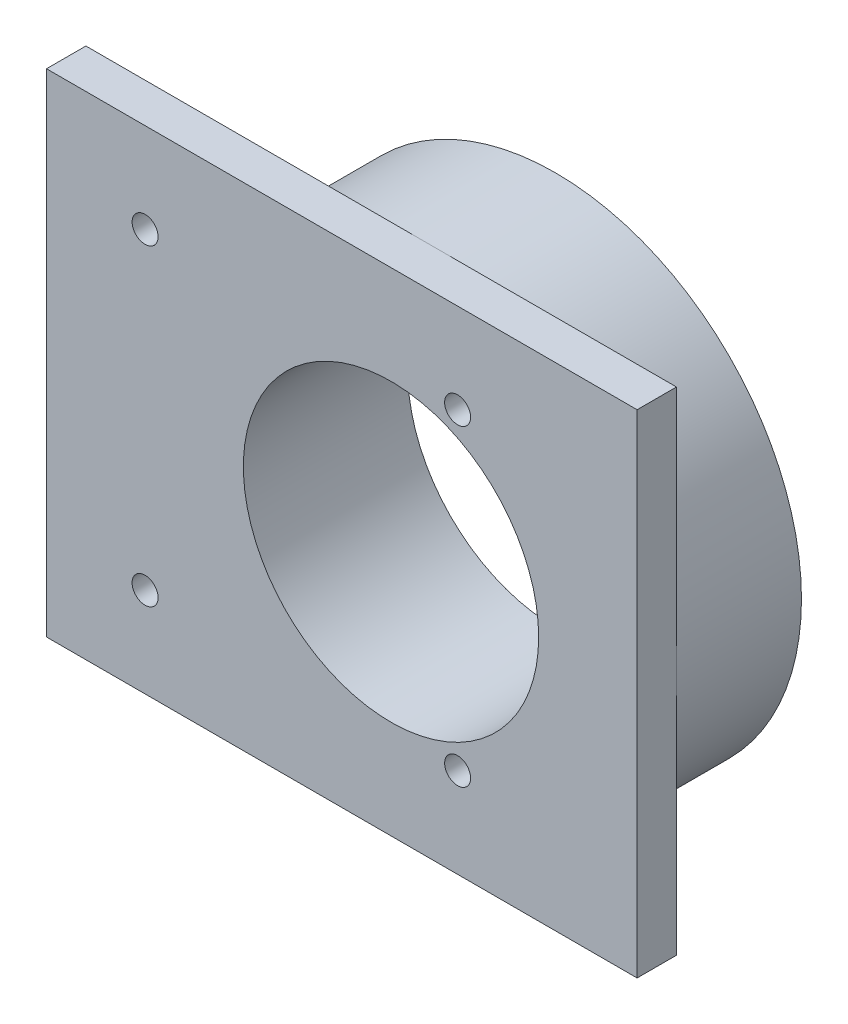
ISO-10303-21;
HEADER;
FILE_DESCRIPTION(('STEP AP214'),'2;1');
FILE_NAME('part.step','',(''),(''),'','','');
FILE_SCHEMA(('AUTOMOTIVE_DESIGN { 1 0 10303 214 1 1 1 1 }'));
ENDSEC;
DATA;
#1=APPLICATION_CONTEXT('core data for automotive mechanical design processes');
#2=APPLICATION_PROTOCOL_DEFINITION('international standard','automotive_design',2000,#1);
#3=PRODUCT_CONTEXT('',#1,'mechanical');
#4=PRODUCT('Part','Part','',(#3));
#5=PRODUCT_RELATED_PRODUCT_CATEGORY('part','',(#4));
#6=PRODUCT_DEFINITION_FORMATION('','',#4);
#7=PRODUCT_DEFINITION_CONTEXT('part definition',#1,'design');
#8=PRODUCT_DEFINITION('design','',#6,#7);
#9=PRODUCT_DEFINITION_SHAPE('','',#8);
#10=(LENGTH_UNIT() NAMED_UNIT(*) SI_UNIT(.MILLI.,.METRE.));
#11=(NAMED_UNIT(*) PLANE_ANGLE_UNIT() SI_UNIT($,.RADIAN.));
#12=(NAMED_UNIT(*) SI_UNIT($,.STERADIAN.) SOLID_ANGLE_UNIT());
#13=UNCERTAINTY_MEASURE_WITH_UNIT(LENGTH_MEASURE(1.E-05),#10,'distance_accuracy_value','');
#14=(GEOMETRIC_REPRESENTATION_CONTEXT(3) GLOBAL_UNCERTAINTY_ASSIGNED_CONTEXT((#13)) GLOBAL_UNIT_ASSIGNED_CONTEXT((#10,
#11,#12)) REPRESENTATION_CONTEXT('',''));
#15=CARTESIAN_POINT('',(0.,0.,0.));
#16=DIRECTION('',(0.,0.,1.));
#17=DIRECTION('',(1.,0.,0.));
#18=AXIS2_PLACEMENT_3D('',#15,#16,#17);
#19=CARTESIAN_POINT('',(0.,0.,12.7));
#20=DIRECTION('',(0.,0.,-1.));
#21=DIRECTION('',(-1.,0.,0.));
#22=AXIS2_PLACEMENT_3D('',#19,#20,#21);
#23=CYLINDRICAL_SURFACE('',#22,25.);
#24=CARTESIAN_POINT('',(0.,0.,12.7));
#25=DIRECTION('',(0.,0.,1.));
#26=DIRECTION('',(1.,0.,0.));
#27=AXIS2_PLACEMENT_3D('',#24,#25,#26);
#28=CIRCLE('',#27,25.);
#29=CARTESIAN_POINT('',(25.,0.,12.7));
#30=VERTEX_POINT('',#29);
#31=CARTESIAN_POINT('',(0.,25.,12.7));
#32=VERTEX_POINT('',#31);
#33=EDGE_CURVE('E11',#30,#32,#28,.T.);
#34=ORIENTED_EDGE('',*,*,#33,.F.);
#35=CARTESIAN_POINT('',(0.,-25.,12.7));
#36=VERTEX_POINT('',#35);
#37=EDGE_CURVE('E42',#36,#30,#28,.T.);
#38=ORIENTED_EDGE('',*,*,#37,.F.);
#39=EDGE_CURVE('E41',#32,#36,#28,.T.);
#40=ORIENTED_EDGE('',*,*,#39,.F.);
#41=EDGE_LOOP('',(#34,#38,#40));
#42=FACE_BOUND('',#41,.T.);
#43=CARTESIAN_POINT('',(0.,0.,0.));
#44=DIRECTION('',(0.,0.,1.));
#45=DIRECTION('',(1.,0.,0.));
#46=AXIS2_PLACEMENT_3D('',#43,#44,#45);
#47=CIRCLE('',#46,25.);
#48=CARTESIAN_POINT('',(25.,0.,0.));
#49=VERTEX_POINT('',#48);
#50=EDGE_CURVE('E36',#49,#49,#47,.T.);
#51=ORIENTED_EDGE('',*,*,#50,.T.);
#52=EDGE_LOOP('',(#51));
#53=FACE_BOUND('',#52,.T.);
#54=ADVANCED_FACE('F33',(#42,#53),#23,.T.);
#55=CARTESIAN_POINT('',(0.,0.,0.));
#56=DIRECTION('',(0.,0.,1.));
#57=DIRECTION('',(1.,0.,0.));
#58=AXIS2_PLACEMENT_3D('',#55,#56,#57);
#59=PLANE('',#58);
#60=CARTESIAN_POINT('',(0.,0.,0.));
#61=DIRECTION('',(0.,0.,1.));
#62=DIRECTION('',(1.,0.,0.));
#63=AXIS2_PLACEMENT_3D('',#60,#61,#62);
#64=CIRCLE('',#63,15.);
#65=CARTESIAN_POINT('',(15.,0.,0.));
#66=VERTEX_POINT('',#65);
#67=EDGE_CURVE('E151',#66,#66,#64,.T.);
#68=ORIENTED_EDGE('',*,*,#67,.T.);
#69=EDGE_LOOP('',(#68));
#70=FACE_BOUND('',#69,.T.);
#71=CARTESIAN_POINT('',(6.765,-15.875,0.));
#72=DIRECTION('',(0.,0.,1.));
#73=DIRECTION('',(1.,0.,0.));
#74=AXIS2_PLACEMENT_3D('',#71,#72,#73);
#75=CIRCLE('',#74,1.32);
#76=CARTESIAN_POINT('',(8.085,-15.875,0.));
#77=VERTEX_POINT('',#76);
#78=EDGE_CURVE('E137',#77,#77,#75,.T.);
#79=ORIENTED_EDGE('',*,*,#78,.T.);
#80=EDGE_LOOP('',(#79));
#81=FACE_BOUND('',#80,.T.);
#82=CARTESIAN_POINT('',(6.76499999999999,15.875,0.));
#83=DIRECTION('',(0.,0.,1.));
#84=DIRECTION('',(1.,0.,0.));
#85=AXIS2_PLACEMENT_3D('',#82,#83,#84);
#86=CIRCLE('',#85,1.32);
#87=CARTESIAN_POINT('',(8.08499999999999,15.875,0.));
#88=VERTEX_POINT('',#87);
#89=EDGE_CURVE('E133',#88,#88,#86,.T.);
#90=ORIENTED_EDGE('',*,*,#89,.T.);
#91=EDGE_LOOP('',(#90));
#92=FACE_BOUND('',#91,.T.);
#93=ORIENTED_EDGE('',*,*,#50,.F.);
#94=EDGE_LOOP('',(#93));
#95=FACE_BOUND('',#94,.T.);
#96=ADVANCED_FACE('F158',(#70,#81,#92,#95),#59,.F.);
#97=CARTESIAN_POINT('',(0.,0.,12.7));
#98=DIRECTION('',(0.,0.,1.));
#99=DIRECTION('',(1.,0.,0.));
#100=AXIS2_PLACEMENT_3D('',#97,#98,#99);
#101=PLANE('',#100);
#102=DIRECTION('',(0.,1.,0.));
#103=VECTOR('',#102,1.);
#104=CARTESIAN_POINT('',(25.,25.,12.7));
#105=LINE('',#104,#103);
#106=CARTESIAN_POINT('',(25.,25.,12.7));
#107=VERTEX_POINT('',#106);
#108=EDGE_CURVE('E120',#30,#107,#105,.T.);
#109=ORIENTED_EDGE('',*,*,#108,.F.);
#110=ORIENTED_EDGE('',*,*,#33,.T.);
#111=DIRECTION('',(-1.,0.,0.));
#112=VECTOR('',#111,1.);
#113=CARTESIAN_POINT('',(-35.,25.,12.7));
#114=LINE('',#113,#112);
#115=EDGE_CURVE('E100',#107,#32,#114,.T.);
#116=ORIENTED_EDGE('',*,*,#115,.F.);
#117=EDGE_LOOP('',(#109,#110,#116));
#118=FACE_BOUND('',#117,.T.);
#119=ADVANCED_FACE('F191',(#118),#101,.F.);
#120=CARTESIAN_POINT('',(-24.985,-15.875,12.7));
#121=DIRECTION('',(0.,0.,1.));
#122=DIRECTION('',(1.,0.,0.));
#123=AXIS2_PLACEMENT_3D('',#120,#121,#122);
#124=CIRCLE('',#123,1.32);
#125=CARTESIAN_POINT('',(-23.665,-15.875,12.7));
#126=VERTEX_POINT('',#125);
#127=EDGE_CURVE('E143',#126,#126,#124,.T.);
#128=ORIENTED_EDGE('',*,*,#127,.T.);
#129=EDGE_LOOP('',(#128));
#130=FACE_BOUND('',#129,.T.);
#131=CARTESIAN_POINT('',(-24.985,15.875,12.7));
#132=DIRECTION('',(0.,0.,1.));
#133=DIRECTION('',(1.,0.,0.));
#134=AXIS2_PLACEMENT_3D('',#131,#132,#133);
#135=CIRCLE('',#134,1.32);
#136=CARTESIAN_POINT('',(-23.665,15.875,12.7));
#137=VERTEX_POINT('',#136);
#138=EDGE_CURVE('E125',#137,#137,#135,.T.);
#139=ORIENTED_EDGE('',*,*,#138,.T.);
#140=EDGE_LOOP('',(#139));
#141=FACE_BOUND('',#140,.T.);
#142=CARTESIAN_POINT('',(-35.,25.,12.7));
#143=VERTEX_POINT('',#142);
#144=EDGE_CURVE('E116',#32,#143,#114,.T.);
#145=ORIENTED_EDGE('',*,*,#144,.F.);
#146=ORIENTED_EDGE('',*,*,#39,.T.);
#147=DIRECTION('',(1.,0.,0.));
#148=VECTOR('',#147,1.);
#149=CARTESIAN_POINT('',(-35.,-25.,12.7));
#150=LINE('',#149,#148);
#151=CARTESIAN_POINT('',(-35.,-25.,12.7));
#152=VERTEX_POINT('',#151);
#153=EDGE_CURVE('E121',#152,#36,#150,.T.);
#154=ORIENTED_EDGE('',*,*,#153,.F.);
#155=DIRECTION('',(0.,-1.,0.));
#156=VECTOR('',#155,1.);
#157=CARTESIAN_POINT('',(-35.,25.,12.7));
#158=LINE('',#157,#156);
#159=EDGE_CURVE('E104',#143,#152,#158,.T.);
#160=ORIENTED_EDGE('',*,*,#159,.F.);
#161=EDGE_LOOP('',(#145,#146,#154,#160));
#162=FACE_BOUND('',#161,.T.);
#163=ADVANCED_FACE('F187',(#130,#141,#162),#101,.F.);
#164=CARTESIAN_POINT('',(25.,-25.,12.7));
#165=VERTEX_POINT('',#164);
#166=EDGE_CURVE('E123',#36,#165,#150,.T.);
#167=ORIENTED_EDGE('',*,*,#166,.F.);
#168=ORIENTED_EDGE('',*,*,#37,.T.);
#169=EDGE_CURVE('E117',#165,#30,#105,.T.);
#170=ORIENTED_EDGE('',*,*,#169,.F.);
#171=EDGE_LOOP('',(#167,#168,#170));
#172=FACE_BOUND('',#171,.T.);
#173=ADVANCED_FACE('F190',(#172),#101,.F.);
#174=CARTESIAN_POINT('',(-35.,25.,16.7));
#175=DIRECTION('',(1.,0.,0.));
#176=DIRECTION('',(0.,1.,0.));
#177=AXIS2_PLACEMENT_3D('',#174,#175,#176);
#178=PLANE('',#177);
#179=ORIENTED_EDGE('',*,*,#159,.T.);
#180=DIRECTION('',(0.,0.,-1.));
#181=VECTOR('',#180,1.);
#182=CARTESIAN_POINT('',(-35.,-25.,16.7));
#183=LINE('',#182,#181);
#184=CARTESIAN_POINT('',(-35.,-25.,16.7));
#185=VERTEX_POINT('',#184);
#186=EDGE_CURVE('E84',#185,#152,#183,.T.);
#187=ORIENTED_EDGE('',*,*,#186,.F.);
#188=DIRECTION('',(0.,-1.,0.));
#189=VECTOR('',#188,1.);
#190=CARTESIAN_POINT('',(-35.,25.,16.7));
#191=LINE('',#190,#189);
#192=CARTESIAN_POINT('',(-35.,25.,16.7));
#193=VERTEX_POINT('',#192);
#194=EDGE_CURVE('E91',#193,#185,#191,.T.);
#195=ORIENTED_EDGE('',*,*,#194,.F.);
#196=DIRECTION('',(0.,0.,-1.));
#197=VECTOR('',#196,1.);
#198=CARTESIAN_POINT('',(-35.,25.,16.7));
#199=LINE('',#198,#197);
#200=EDGE_CURVE('E112',#193,#143,#199,.T.);
#201=ORIENTED_EDGE('',*,*,#200,.T.);
#202=EDGE_LOOP('',(#179,#187,#195,#201));
#203=FACE_BOUND('',#202,.T.);
#204=ADVANCED_FACE('F102',(#203),#178,.F.);
#205=CARTESIAN_POINT('',(-35.,-25.,16.7));
#206=DIRECTION('',(0.,1.,0.));
#207=DIRECTION('',(0.,0.,1.));
#208=AXIS2_PLACEMENT_3D('',#205,#206,#207);
#209=PLANE('',#208);
#210=ORIENTED_EDGE('',*,*,#153,.T.);
#211=ORIENTED_EDGE('',*,*,#166,.T.);
#212=DIRECTION('',(0.,0.,-1.));
#213=VECTOR('',#212,1.);
#214=CARTESIAN_POINT('',(25.,-25.,16.7));
#215=LINE('',#214,#213);
#216=CARTESIAN_POINT('',(25.,-25.,16.7));
#217=VERTEX_POINT('',#216);
#218=EDGE_CURVE('E87',#217,#165,#215,.T.);
#219=ORIENTED_EDGE('',*,*,#218,.F.);
#220=DIRECTION('',(1.,0.,0.));
#221=VECTOR('',#220,1.);
#222=CARTESIAN_POINT('',(-35.,-25.,16.7));
#223=LINE('',#222,#221);
#224=EDGE_CURVE('E79',#185,#217,#223,.T.);
#225=ORIENTED_EDGE('',*,*,#224,.F.);
#226=ORIENTED_EDGE('',*,*,#186,.T.);
#227=EDGE_LOOP('',(#210,#211,#219,#225,#226));
#228=FACE_BOUND('',#227,.T.);
#229=ADVANCED_FACE('F82',(#228),#209,.F.);
#230=CARTESIAN_POINT('',(25.,25.,16.7));
#231=DIRECTION('',(-1.,0.,0.));
#232=DIRECTION('',(0.,-1.,0.));
#233=AXIS2_PLACEMENT_3D('',#230,#231,#232);
#234=PLANE('',#233);
#235=ORIENTED_EDGE('',*,*,#169,.T.);
#236=ORIENTED_EDGE('',*,*,#108,.T.);
#237=DIRECTION('',(0.,0.,-1.));
#238=VECTOR('',#237,1.);
#239=CARTESIAN_POINT('',(25.,25.,16.7));
#240=LINE('',#239,#238);
#241=CARTESIAN_POINT('',(25.,25.,16.7));
#242=VERTEX_POINT('',#241);
#243=EDGE_CURVE('E107',#242,#107,#240,.T.);
#244=ORIENTED_EDGE('',*,*,#243,.F.);
#245=DIRECTION('',(0.,1.,0.));
#246=VECTOR('',#245,1.);
#247=CARTESIAN_POINT('',(25.,25.,16.7));
#248=LINE('',#247,#246);
#249=EDGE_CURVE('E90',#217,#242,#248,.T.);
#250=ORIENTED_EDGE('',*,*,#249,.F.);
#251=ORIENTED_EDGE('',*,*,#218,.T.);
#252=EDGE_LOOP('',(#235,#236,#244,#250,#251));
#253=FACE_BOUND('',#252,.T.);
#254=ADVANCED_FACE('F205',(#253),#234,.F.);
#255=CARTESIAN_POINT('',(-35.,25.,16.7));
#256=DIRECTION('',(0.,-1.,0.));
#257=DIRECTION('',(0.,0.,-1.));
#258=AXIS2_PLACEMENT_3D('',#255,#256,#257);
#259=PLANE('',#258);
#260=ORIENTED_EDGE('',*,*,#115,.T.);
#261=ORIENTED_EDGE('',*,*,#144,.T.);
#262=ORIENTED_EDGE('',*,*,#200,.F.);
#263=DIRECTION('',(-1.,0.,0.));
#264=VECTOR('',#263,1.);
#265=CARTESIAN_POINT('',(-35.,25.,16.7));
#266=LINE('',#265,#264);
#267=EDGE_CURVE('E96',#242,#193,#266,.T.);
#268=ORIENTED_EDGE('',*,*,#267,.F.);
#269=ORIENTED_EDGE('',*,*,#243,.T.);
#270=EDGE_LOOP('',(#260,#261,#262,#268,#269));
#271=FACE_BOUND('',#270,.T.);
#272=ADVANCED_FACE('F171',(#271),#259,.F.);
#273=CARTESIAN_POINT('',(0.,0.,16.7));
#274=DIRECTION('',(0.,0.,1.));
#275=DIRECTION('',(1.,0.,0.));
#276=AXIS2_PLACEMENT_3D('',#273,#274,#275);
#277=PLANE('',#276);
#278=CARTESIAN_POINT('',(0.,0.,16.7));
#279=DIRECTION('',(0.,0.,1.));
#280=DIRECTION('',(1.,0.,0.));
#281=AXIS2_PLACEMENT_3D('',#278,#279,#280);
#282=CIRCLE('',#281,15.);
#283=CARTESIAN_POINT('',(15.,0.,16.7));
#284=VERTEX_POINT('',#283);
#285=EDGE_CURVE('E152',#284,#284,#282,.T.);
#286=ORIENTED_EDGE('',*,*,#285,.F.);
#287=EDGE_LOOP('',(#286));
#288=FACE_BOUND('',#287,.T.);
#289=CARTESIAN_POINT('',(-24.985,-15.875,16.7));
#290=DIRECTION('',(0.,0.,1.));
#291=DIRECTION('',(1.,0.,0.));
#292=AXIS2_PLACEMENT_3D('',#289,#290,#291);
#293=CIRCLE('',#292,1.32);
#294=CARTESIAN_POINT('',(-23.665,-15.875,16.7));
#295=VERTEX_POINT('',#294);
#296=EDGE_CURVE('E148',#295,#295,#293,.T.);
#297=ORIENTED_EDGE('',*,*,#296,.F.);
#298=EDGE_LOOP('',(#297));
#299=FACE_BOUND('',#298,.T.);
#300=CARTESIAN_POINT('',(6.765,-15.875,16.7));
#301=DIRECTION('',(0.,0.,1.));
#302=DIRECTION('',(1.,0.,0.));
#303=AXIS2_PLACEMENT_3D('',#300,#301,#302);
#304=CIRCLE('',#303,1.32);
#305=CARTESIAN_POINT('',(8.085,-15.875,16.7));
#306=VERTEX_POINT('',#305);
#307=EDGE_CURVE('E140',#306,#306,#304,.T.);
#308=ORIENTED_EDGE('',*,*,#307,.F.);
#309=EDGE_LOOP('',(#308));
#310=FACE_BOUND('',#309,.T.);
#311=CARTESIAN_POINT('',(6.76499999999999,15.875,16.7));
#312=DIRECTION('',(0.,0.,1.));
#313=DIRECTION('',(1.,0.,0.));
#314=AXIS2_PLACEMENT_3D('',#311,#312,#313);
#315=CIRCLE('',#314,1.32);
#316=CARTESIAN_POINT('',(8.08499999999999,15.875,16.7));
#317=VERTEX_POINT('',#316);
#318=EDGE_CURVE('E134',#317,#317,#315,.T.);
#319=ORIENTED_EDGE('',*,*,#318,.F.);
#320=EDGE_LOOP('',(#319));
#321=FACE_BOUND('',#320,.T.);
#322=CARTESIAN_POINT('',(-24.985,15.875,16.7));
#323=DIRECTION('',(0.,0.,1.));
#324=DIRECTION('',(1.,0.,0.));
#325=AXIS2_PLACEMENT_3D('',#322,#323,#324);
#326=CIRCLE('',#325,1.32);
#327=CARTESIAN_POINT('',(-23.665,15.875,16.7));
#328=VERTEX_POINT('',#327);
#329=EDGE_CURVE('E130',#328,#328,#326,.T.);
#330=ORIENTED_EDGE('',*,*,#329,.F.);
#331=EDGE_LOOP('',(#330));
#332=FACE_BOUND('',#331,.T.);
#333=ORIENTED_EDGE('',*,*,#194,.T.);
#334=ORIENTED_EDGE('',*,*,#224,.T.);
#335=ORIENTED_EDGE('',*,*,#249,.T.);
#336=ORIENTED_EDGE('',*,*,#267,.T.);
#337=EDGE_LOOP('',(#333,#334,#335,#336));
#338=FACE_BOUND('',#337,.T.);
#339=ADVANCED_FACE('F94',(#288,#299,#310,#321,#332,#338),#277,.T.);
#340=CARTESIAN_POINT('',(-24.985,15.875,0.));
#341=DIRECTION('',(0.,0.,1.));
#342=DIRECTION('',(1.,0.,0.));
#343=AXIS2_PLACEMENT_3D('',#340,#341,#342);
#344=CYLINDRICAL_SURFACE('',#343,1.32);
#345=ORIENTED_EDGE('',*,*,#329,.T.);
#346=EDGE_LOOP('',(#345));
#347=FACE_BOUND('',#346,.T.);
#348=ORIENTED_EDGE('',*,*,#138,.F.);
#349=EDGE_LOOP('',(#348));
#350=FACE_BOUND('',#349,.T.);
#351=ADVANCED_FACE('F170',(#347,#350),#344,.F.);
#352=CARTESIAN_POINT('',(6.76499999999999,15.875,0.));
#353=DIRECTION('',(0.,0.,1.));
#354=DIRECTION('',(1.,0.,0.));
#355=AXIS2_PLACEMENT_3D('',#352,#353,#354);
#356=CYLINDRICAL_SURFACE('',#355,1.32);
#357=ORIENTED_EDGE('',*,*,#89,.F.);
#358=EDGE_LOOP('',(#357));
#359=FACE_BOUND('',#358,.T.);
#360=ORIENTED_EDGE('',*,*,#318,.T.);
#361=EDGE_LOOP('',(#360));
#362=FACE_BOUND('',#361,.T.);
#363=ADVANCED_FACE('F183',(#359,#362),#356,.F.);
#364=CARTESIAN_POINT('',(6.765,-15.875,0.));
#365=DIRECTION('',(0.,0.,1.));
#366=DIRECTION('',(1.,0.,0.));
#367=AXIS2_PLACEMENT_3D('',#364,#365,#366);
#368=CYLINDRICAL_SURFACE('',#367,1.32);
#369=ORIENTED_EDGE('',*,*,#78,.F.);
#370=EDGE_LOOP('',(#369));
#371=FACE_BOUND('',#370,.T.);
#372=ORIENTED_EDGE('',*,*,#307,.T.);
#373=EDGE_LOOP('',(#372));
#374=FACE_BOUND('',#373,.T.);
#375=ADVANCED_FACE('F231',(#371,#374),#368,.F.);
#376=CARTESIAN_POINT('',(-24.985,-15.875,0.));
#377=DIRECTION('',(0.,0.,1.));
#378=DIRECTION('',(1.,0.,0.));
#379=AXIS2_PLACEMENT_3D('',#376,#377,#378);
#380=CYLINDRICAL_SURFACE('',#379,1.32);
#381=ORIENTED_EDGE('',*,*,#296,.T.);
#382=EDGE_LOOP('',(#381));
#383=FACE_BOUND('',#382,.T.);
#384=ORIENTED_EDGE('',*,*,#127,.F.);
#385=EDGE_LOOP('',(#384));
#386=FACE_BOUND('',#385,.T.);
#387=ADVANCED_FACE('F164',(#383,#386),#380,.F.);
#388=CARTESIAN_POINT('',(0.,0.,0.));
#389=DIRECTION('',(0.,0.,1.));
#390=DIRECTION('',(1.,0.,0.));
#391=AXIS2_PLACEMENT_3D('',#388,#389,#390);
#392=CYLINDRICAL_SURFACE('',#391,15.);
#393=ORIENTED_EDGE('',*,*,#67,.F.);
#394=EDGE_LOOP('',(#393));
#395=FACE_BOUND('',#394,.T.);
#396=ORIENTED_EDGE('',*,*,#285,.T.);
#397=EDGE_LOOP('',(#396));
#398=FACE_BOUND('',#397,.T.);
#399=ADVANCED_FACE('F161',(#395,#398),#392,.F.);
#400=CLOSED_SHELL('',(#54,#96,#119,#163,#173,#204,#229,#254,#272,#339,#351,#363,#375,#387,#399));
#401=MANIFOLD_SOLID_BREP('B2',#400);
#402=ADVANCED_BREP_SHAPE_REPRESENTATION('',(#18,#401),#14);
#403=SHAPE_DEFINITION_REPRESENTATION(#9,#402);
ENDSEC;
END-ISO-10303-21;
